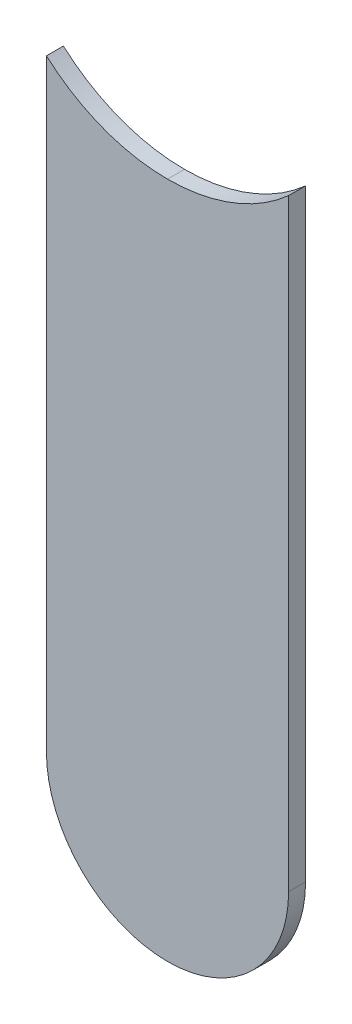
ISO-10303-21;
HEADER;
FILE_DESCRIPTION(('STEP AP214'),'2;1');
FILE_NAME('part.step','',(''),(''),'','','');
FILE_SCHEMA(('AUTOMOTIVE_DESIGN { 1 0 10303 214 1 1 1 1 }'));
ENDSEC;
DATA;
#1=APPLICATION_CONTEXT('core data for automotive mechanical design processes');
#2=APPLICATION_PROTOCOL_DEFINITION('international standard','automotive_design',2000,#1);
#3=PRODUCT_CONTEXT('',#1,'mechanical');
#4=PRODUCT('Part','Part','',(#3));
#5=PRODUCT_RELATED_PRODUCT_CATEGORY('part','',(#4));
#6=PRODUCT_DEFINITION_FORMATION('','',#4);
#7=PRODUCT_DEFINITION_CONTEXT('part definition',#1,'design');
#8=PRODUCT_DEFINITION('design','',#6,#7);
#9=PRODUCT_DEFINITION_SHAPE('','',#8);
#10=(LENGTH_UNIT() NAMED_UNIT(*) SI_UNIT(.MILLI.,.METRE.));
#11=(NAMED_UNIT(*) PLANE_ANGLE_UNIT() SI_UNIT($,.RADIAN.));
#12=(NAMED_UNIT(*) SI_UNIT($,.STERADIAN.) SOLID_ANGLE_UNIT());
#13=UNCERTAINTY_MEASURE_WITH_UNIT(LENGTH_MEASURE(1.E-05),#10,'distance_accuracy_value','');
#14=(GEOMETRIC_REPRESENTATION_CONTEXT(3) GLOBAL_UNCERTAINTY_ASSIGNED_CONTEXT((#13)) GLOBAL_UNIT_ASSIGNED_CONTEXT((#10,
#11,#12)) REPRESENTATION_CONTEXT('',''));
#15=CARTESIAN_POINT('',(0.,0.,0.));
#16=DIRECTION('',(0.,0.,1.));
#17=DIRECTION('',(1.,0.,0.));
#18=AXIS2_PLACEMENT_3D('',#15,#16,#17);
#19=CARTESIAN_POINT('',(139.7,-103.632,-0.045));
#20=DIRECTION('',(0.,0.,-1.));
#21=DIRECTION('',(0.,-1.,0.));
#22=AXIS2_PLACEMENT_3D('',#19,#20,#21);
#23=CYLINDRICAL_SURFACE('',#22,0.375);
#24=DIRECTION('',(0.,0.,1.));
#25=VECTOR('',#24,1.);
#26=CARTESIAN_POINT('',(139.7,-104.007,-0.045));
#27=LINE('',#26,#25);
#28=CARTESIAN_POINT('',(139.7,-104.007,-0.035));
#29=VERTEX_POINT('',#28);
#30=CARTESIAN_POINT('',(139.7,-104.007,0.));
#31=VERTEX_POINT('',#30);
#32=EDGE_CURVE('E58',#29,#31,#27,.T.);
#33=ORIENTED_EDGE('',*,*,#32,.F.);
#34=CARTESIAN_POINT('',(139.7,-103.632,-0.035));
#35=DIRECTION('',(0.,0.,-1.));
#36=DIRECTION('',(0.,-1.,0.));
#37=AXIS2_PLACEMENT_3D('',#34,#35,#36);
#38=CIRCLE('',#37,0.375);
#39=CARTESIAN_POINT('',(139.45,-103.9115084972,-0.035));
#40=VERTEX_POINT('',#39);
#41=EDGE_CURVE('E92',#29,#40,#38,.T.);
#42=ORIENTED_EDGE('',*,*,#41,.T.);
#43=DIRECTION('',(0.,0.,-1.));
#44=VECTOR('',#43,1.);
#45=CARTESIAN_POINT('',(139.45,-103.9115084971,-0.045));
#46=LINE('',#45,#44);
#47=CARTESIAN_POINT('',(139.45,-103.9115084972,0.));
#48=VERTEX_POINT('',#47);
#49=EDGE_CURVE('E11',#48,#40,#46,.T.);
#50=ORIENTED_EDGE('',*,*,#49,.F.);
#51=CARTESIAN_POINT('',(139.7,-103.632,0.));
#52=DIRECTION('',(0.,0.,-1.));
#53=DIRECTION('',(0.,-1.,0.));
#54=AXIS2_PLACEMENT_3D('',#51,#52,#53);
#55=CIRCLE('',#54,0.375);
#56=EDGE_CURVE('E55',#31,#48,#55,.T.);
#57=ORIENTED_EDGE('',*,*,#56,.F.);
#58=EDGE_LOOP('',(#33,#42,#50,#57));
#59=FACE_BOUND('',#58,.T.);
#60=ADVANCED_FACE('F17',(#59),#23,.F.);
#61=CARTESIAN_POINT('',(139.45,-103.632,-0.035));
#62=DIRECTION('',(1.,0.,0.));
#63=DIRECTION('',(0.,1.,0.));
#64=AXIS2_PLACEMENT_3D('',#61,#62,#63);
#65=PLANE('',#64);
#66=DIRECTION('',(0.,0.,1.));
#67=VECTOR('',#66,1.);
#68=CARTESIAN_POINT('',(139.45,-105.156,-0.035));
#69=LINE('',#68,#67);
#70=CARTESIAN_POINT('',(139.45,-105.156,-0.035));
#71=VERTEX_POINT('',#70);
#72=CARTESIAN_POINT('',(139.45,-105.156,0.));
#73=VERTEX_POINT('',#72);
#74=EDGE_CURVE('E27',#71,#73,#69,.T.);
#75=ORIENTED_EDGE('',*,*,#74,.T.);
#76=DIRECTION('',(0.,-1.,0.));
#77=VECTOR('',#76,1.);
#78=CARTESIAN_POINT('',(139.45,-103.632,0.));
#79=LINE('',#78,#77);
#80=EDGE_CURVE('E63',#48,#73,#79,.T.);
#81=ORIENTED_EDGE('',*,*,#80,.F.);
#82=ORIENTED_EDGE('',*,*,#49,.T.);
#83=DIRECTION('',(0.,-1.,0.));
#84=VECTOR('',#83,1.);
#85=CARTESIAN_POINT('',(139.45,-103.632,-0.035));
#86=LINE('',#85,#84);
#87=EDGE_CURVE('E130',#40,#71,#86,.T.);
#88=ORIENTED_EDGE('',*,*,#87,.T.);
#89=EDGE_LOOP('',(#75,#81,#82,#88));
#90=FACE_BOUND('',#89,.T.);
#91=ADVANCED_FACE('F19',(#90),#65,.F.);
#92=CARTESIAN_POINT('',(139.7,-105.156,-0.035));
#93=DIRECTION('',(0.,0.,-1.));
#94=DIRECTION('',(-1.,0.,0.));
#95=AXIS2_PLACEMENT_3D('',#92,#93,#94);
#96=CYLINDRICAL_SURFACE('',#95,0.25);
#97=CARTESIAN_POINT('',(139.7,-105.156,-0.035));
#98=DIRECTION('',(0.,0.,1.));
#99=DIRECTION('',(-1.,0.,0.));
#100=AXIS2_PLACEMENT_3D('',#97,#98,#99);
#101=CIRCLE('',#100,0.25);
#102=CARTESIAN_POINT('',(139.95,-105.156,-0.035));
#103=VERTEX_POINT('',#102);
#104=EDGE_CURVE('E83',#71,#103,#101,.T.);
#105=ORIENTED_EDGE('',*,*,#104,.T.);
#106=DIRECTION('',(0.,0.,1.));
#107=VECTOR('',#106,1.);
#108=CARTESIAN_POINT('',(139.95,-105.156,-0.035));
#109=LINE('',#108,#107);
#110=CARTESIAN_POINT('',(139.95,-105.156,0.));
#111=VERTEX_POINT('',#110);
#112=EDGE_CURVE('E108',#103,#111,#109,.T.);
#113=ORIENTED_EDGE('',*,*,#112,.T.);
#114=CARTESIAN_POINT('',(139.7,-105.156,0.));
#115=DIRECTION('',(0.,0.,1.));
#116=DIRECTION('',(-1.,0.,0.));
#117=AXIS2_PLACEMENT_3D('',#114,#115,#116);
#118=CIRCLE('',#117,0.25);
#119=EDGE_CURVE('E64',#73,#111,#118,.T.);
#120=ORIENTED_EDGE('',*,*,#119,.F.);
#121=ORIENTED_EDGE('',*,*,#74,.F.);
#122=EDGE_LOOP('',(#105,#113,#120,#121));
#123=FACE_BOUND('',#122,.T.);
#124=ADVANCED_FACE('F109',(#123),#96,.T.);
#125=CARTESIAN_POINT('',(139.95,-105.156,0.));
#126=DIRECTION('',(0.,0.,1.));
#127=DIRECTION('',(1.,0.,0.));
#128=AXIS2_PLACEMENT_3D('',#125,#126,#127);
#129=PLANE('',#128);
#130=ORIENTED_EDGE('',*,*,#119,.T.);
#131=DIRECTION('',(0.,1.,0.));
#132=VECTOR('',#131,1.);
#133=CARTESIAN_POINT('',(139.95,-105.156,0.));
#134=LINE('',#133,#132);
#135=CARTESIAN_POINT('',(139.95,-103.9115084971,0.));
#136=VERTEX_POINT('',#135);
#137=EDGE_CURVE('E72',#111,#136,#134,.T.);
#138=ORIENTED_EDGE('',*,*,#137,.T.);
#139=CARTESIAN_POINT('',(139.7,-103.632,0.));
#140=DIRECTION('',(0.,0.,-1.));
#141=DIRECTION('',(0.,-1.,0.));
#142=AXIS2_PLACEMENT_3D('',#139,#140,#141);
#143=CIRCLE('',#142,0.375);
#144=EDGE_CURVE('E67',#136,#31,#143,.T.);
#145=ORIENTED_EDGE('',*,*,#144,.T.);
#146=ORIENTED_EDGE('',*,*,#56,.T.);
#147=ORIENTED_EDGE('',*,*,#80,.T.);
#148=EDGE_LOOP('',(#130,#138,#145,#146,#147));
#149=FACE_BOUND('',#148,.T.);
#150=ADVANCED_FACE('F69',(#149),#129,.T.);
#151=CARTESIAN_POINT('',(139.7,-103.632,-0.045));
#152=DIRECTION('',(0.,0.,-1.));
#153=DIRECTION('',(0.,-1.,0.));
#154=AXIS2_PLACEMENT_3D('',#151,#152,#153);
#155=CYLINDRICAL_SURFACE('',#154,0.375);
#156=CARTESIAN_POINT('',(139.7,-103.632,-0.035));
#157=DIRECTION('',(0.,0.,-1.));
#158=DIRECTION('',(0.,-1.,0.));
#159=AXIS2_PLACEMENT_3D('',#156,#157,#158);
#160=CIRCLE('',#159,0.375);
#161=CARTESIAN_POINT('',(139.95,-103.9115084971,-0.035));
#162=VERTEX_POINT('',#161);
#163=EDGE_CURVE('E80',#162,#29,#160,.T.);
#164=ORIENTED_EDGE('',*,*,#163,.T.);
#165=ORIENTED_EDGE('',*,*,#32,.T.);
#166=ORIENTED_EDGE('',*,*,#144,.F.);
#167=DIRECTION('',(0.,0.,-1.));
#168=VECTOR('',#167,1.);
#169=CARTESIAN_POINT('',(139.95,-103.9115084971,-0.045));
#170=LINE('',#169,#168);
#171=EDGE_CURVE('E118',#136,#162,#170,.T.);
#172=ORIENTED_EDGE('',*,*,#171,.T.);
#173=EDGE_LOOP('',(#164,#165,#166,#172));
#174=FACE_BOUND('',#173,.T.);
#175=ADVANCED_FACE('F78',(#174),#155,.F.);
#176=CARTESIAN_POINT('',(139.95,-105.156,-0.035));
#177=DIRECTION('',(0.,0.,1.));
#178=DIRECTION('',(1.,0.,0.));
#179=AXIS2_PLACEMENT_3D('',#176,#177,#178);
#180=PLANE('',#179);
#181=ORIENTED_EDGE('',*,*,#87,.F.);
#182=ORIENTED_EDGE('',*,*,#41,.F.);
#183=ORIENTED_EDGE('',*,*,#163,.F.);
#184=DIRECTION('',(0.,1.,0.));
#185=VECTOR('',#184,1.);
#186=CARTESIAN_POINT('',(139.95,-105.156,-0.035));
#187=LINE('',#186,#185);
#188=EDGE_CURVE('E115',#103,#162,#187,.T.);
#189=ORIENTED_EDGE('',*,*,#188,.F.);
#190=ORIENTED_EDGE('',*,*,#104,.F.);
#191=EDGE_LOOP('',(#181,#182,#183,#189,#190));
#192=FACE_BOUND('',#191,.T.);
#193=ADVANCED_FACE('F142',(#192),#180,.F.);
#194=CARTESIAN_POINT('',(139.95,-105.156,-0.035));
#195=DIRECTION('',(-1.,0.,0.));
#196=DIRECTION('',(0.,0.,1.));
#197=AXIS2_PLACEMENT_3D('',#194,#195,#196);
#198=PLANE('',#197);
#199=ORIENTED_EDGE('',*,*,#171,.F.);
#200=ORIENTED_EDGE('',*,*,#137,.F.);
#201=ORIENTED_EDGE('',*,*,#112,.F.);
#202=ORIENTED_EDGE('',*,*,#188,.T.);
#203=EDGE_LOOP('',(#199,#200,#201,#202));
#204=FACE_BOUND('',#203,.T.);
#205=ADVANCED_FACE('F117',(#204),#198,.F.);
#206=CLOSED_SHELL('',(#60,#91,#124,#150,#175,#193,#205));
#207=MANIFOLD_SOLID_BREP('B1',#206);
#208=ADVANCED_BREP_SHAPE_REPRESENTATION('',(#18,#207),#14);
#209=SHAPE_DEFINITION_REPRESENTATION(#9,#208);
ENDSEC;
END-ISO-10303-21;
